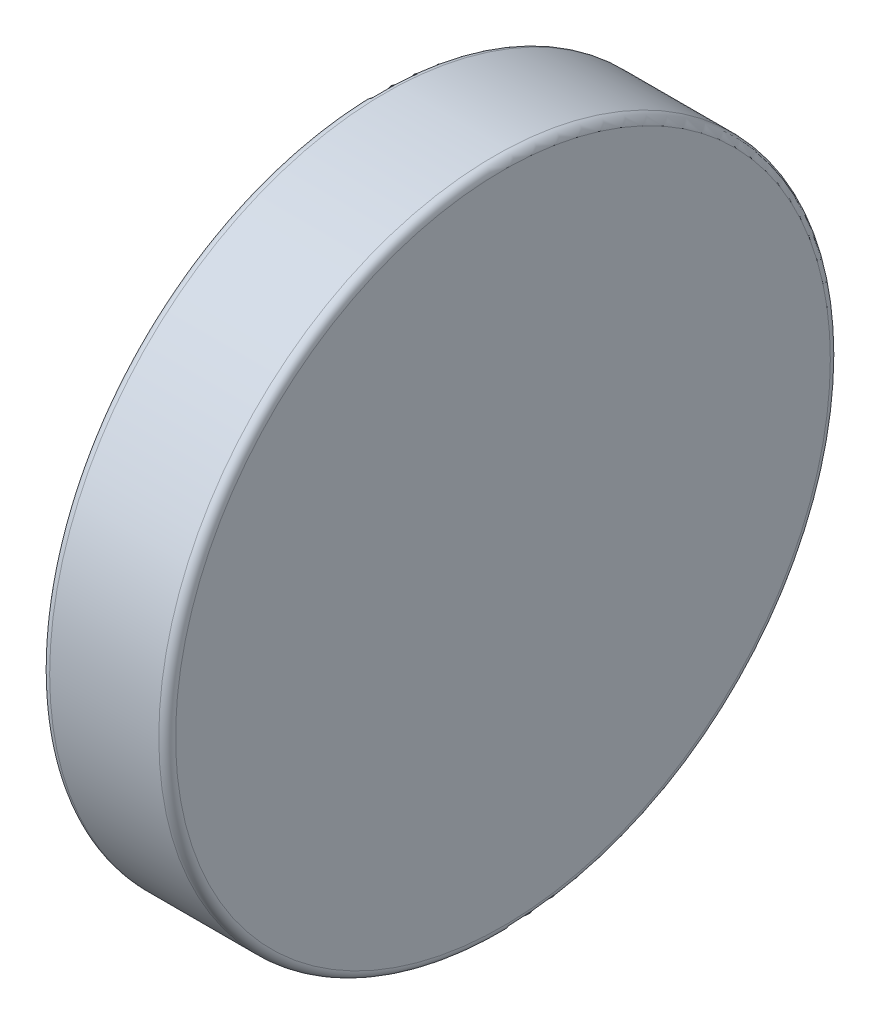
ISO-10303-21;
HEADER;
FILE_DESCRIPTION(('STEP AP214'),'2;1');
FILE_NAME('part.step','',(''),(''),'','','');
FILE_SCHEMA(('AUTOMOTIVE_DESIGN { 1 0 10303 214 1 1 1 1 }'));
ENDSEC;
DATA;
#1=APPLICATION_CONTEXT('core data for automotive mechanical design processes');
#2=APPLICATION_PROTOCOL_DEFINITION('international standard','automotive_design',2000,#1);
#3=PRODUCT_CONTEXT('',#1,'mechanical');
#4=PRODUCT('Part','Part','',(#3));
#5=PRODUCT_RELATED_PRODUCT_CATEGORY('part','',(#4));
#6=PRODUCT_DEFINITION_FORMATION('','',#4);
#7=PRODUCT_DEFINITION_CONTEXT('part definition',#1,'design');
#8=PRODUCT_DEFINITION('design','',#6,#7);
#9=PRODUCT_DEFINITION_SHAPE('','',#8);
#10=(LENGTH_UNIT() NAMED_UNIT(*) SI_UNIT(.MILLI.,.METRE.));
#11=(NAMED_UNIT(*) PLANE_ANGLE_UNIT() SI_UNIT($,.RADIAN.));
#12=(NAMED_UNIT(*) SI_UNIT($,.STERADIAN.) SOLID_ANGLE_UNIT());
#13=UNCERTAINTY_MEASURE_WITH_UNIT(LENGTH_MEASURE(1.E-05),#10,'distance_accuracy_value','');
#14=(GEOMETRIC_REPRESENTATION_CONTEXT(3) GLOBAL_UNCERTAINTY_ASSIGNED_CONTEXT((#13)) GLOBAL_UNIT_ASSIGNED_CONTEXT((#10,
#11,#12)) REPRESENTATION_CONTEXT('',''));
#15=CARTESIAN_POINT('',(0.,0.,0.));
#16=DIRECTION('',(0.,0.,1.));
#17=DIRECTION('',(1.,0.,0.));
#18=AXIS2_PLACEMENT_3D('',#15,#16,#17);
#19=CARTESIAN_POINT('',(1.5,0.,0.));
#20=DIRECTION('',(-1.,0.,0.));
#21=DIRECTION('',(0.,0.,1.));
#22=AXIS2_PLACEMENT_3D('',#19,#20,#21);
#23=CYLINDRICAL_SURFACE('',#22,4.);
#24=CARTESIAN_POINT('',(1.4,0.,0.));
#25=DIRECTION('',(1.,0.,0.));
#26=DIRECTION('',(0.,0.,-1.));
#27=AXIS2_PLACEMENT_3D('',#24,#25,#26);
#28=CIRCLE('',#27,4.);
#29=CARTESIAN_POINT('',(1.4,0.,-4.));
#30=VERTEX_POINT('',#29);
#31=EDGE_CURVE('E44',#30,#30,#28,.F.);
#32=ORIENTED_EDGE('',*,*,#31,.T.);
#33=EDGE_LOOP('',(#32));
#34=FACE_BOUND('',#33,.T.);
#35=CARTESIAN_POINT('',(0.1,0.,0.));
#36=DIRECTION('',(1.,0.,0.));
#37=DIRECTION('',(0.,0.,-1.));
#38=AXIS2_PLACEMENT_3D('',#35,#36,#37);
#39=CIRCLE('',#38,4.);
#40=CARTESIAN_POINT('',(0.1,0.,-4.));
#41=VERTEX_POINT('',#40);
#42=EDGE_CURVE('E48',#41,#41,#39,.T.);
#43=ORIENTED_EDGE('',*,*,#42,.T.);
#44=EDGE_LOOP('',(#43));
#45=FACE_BOUND('',#44,.T.);
#46=ADVANCED_FACE('F37',(#34,#45),#23,.T.);
#47=CARTESIAN_POINT('',(1.5,0.,0.));
#48=DIRECTION('',(1.,0.,0.));
#49=DIRECTION('',(0.,0.,-1.));
#50=AXIS2_PLACEMENT_3D('',#47,#48,#49);
#51=PLANE('',#50);
#52=CARTESIAN_POINT('',(1.5,0.,0.));
#53=DIRECTION('',(1.,0.,0.));
#54=DIRECTION('',(0.,0.,-1.));
#55=AXIS2_PLACEMENT_3D('',#52,#53,#54);
#56=CIRCLE('',#55,3.9);
#57=CARTESIAN_POINT('',(1.5,0.,-3.9));
#58=VERTEX_POINT('',#57);
#59=EDGE_CURVE('E52',#58,#58,#56,.T.);
#60=ORIENTED_EDGE('',*,*,#59,.T.);
#61=EDGE_LOOP('',(#60));
#62=FACE_BOUND('',#61,.T.);
#63=ADVANCED_FACE('F58',(#62),#51,.T.);
#64=CARTESIAN_POINT('',(0.,0.,0.));
#65=DIRECTION('',(1.,0.,0.));
#66=DIRECTION('',(0.,0.,-1.));
#67=AXIS2_PLACEMENT_3D('',#64,#65,#66);
#68=PLANE('',#67);
#69=CARTESIAN_POINT('',(0.,0.,0.));
#70=DIRECTION('',(1.,0.,0.));
#71=DIRECTION('',(0.,0.,-1.));
#72=AXIS2_PLACEMENT_3D('',#69,#70,#71);
#73=CIRCLE('',#72,3.9);
#74=CARTESIAN_POINT('',(0.,0.,-3.9));
#75=VERTEX_POINT('',#74);
#76=EDGE_CURVE('E10',#75,#75,#73,.F.);
#77=ORIENTED_EDGE('',*,*,#76,.T.);
#78=EDGE_LOOP('',(#77));
#79=FACE_BOUND('',#78,.T.);
#80=ADVANCED_FACE('F62',(#79),#68,.F.);
#81=CARTESIAN_POINT('',(1.4,0.,0.));
#82=DIRECTION('',(1.,0.,0.));
#83=DIRECTION('',(0.,0.,-1.));
#84=AXIS2_PLACEMENT_3D('',#81,#82,#83);
#85=TOROIDAL_SURFACE('',#84,3.9,0.1);
#86=ORIENTED_EDGE('',*,*,#31,.F.);
#87=EDGE_LOOP('',(#86));
#88=FACE_BOUND('',#87,.T.);
#89=ORIENTED_EDGE('',*,*,#59,.F.);
#90=EDGE_LOOP('',(#89));
#91=FACE_BOUND('',#90,.T.);
#92=ADVANCED_FACE('F60',(#88,#91),#85,.T.);
#93=CARTESIAN_POINT('',(0.1,0.,0.));
#94=DIRECTION('',(1.,0.,0.));
#95=DIRECTION('',(0.,0.,-1.));
#96=AXIS2_PLACEMENT_3D('',#93,#94,#95);
#97=TOROIDAL_SURFACE('',#96,3.9,0.1);
#98=ORIENTED_EDGE('',*,*,#76,.F.);
#99=EDGE_LOOP('',(#98));
#100=FACE_BOUND('',#99,.T.);
#101=ORIENTED_EDGE('',*,*,#42,.F.);
#102=EDGE_LOOP('',(#101));
#103=FACE_BOUND('',#102,.T.);
#104=ADVANCED_FACE('F39',(#100,#103),#97,.T.);
#105=CLOSED_SHELL('',(#46,#63,#80,#92,#104));
#106=MANIFOLD_SOLID_BREP('B2',#105);
#107=ADVANCED_BREP_SHAPE_REPRESENTATION('',(#18,#106),#14);
#108=SHAPE_DEFINITION_REPRESENTATION(#9,#107);
ENDSEC;
END-ISO-10303-21;
